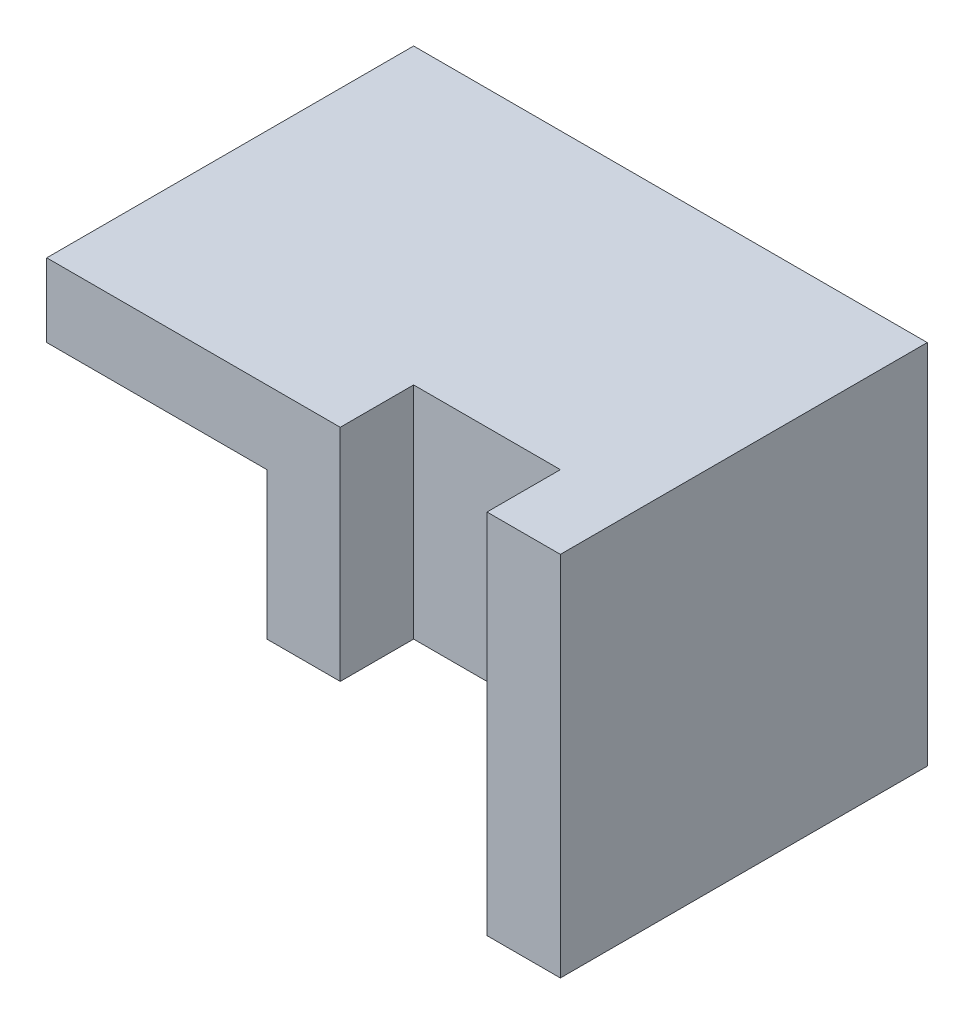
ISO-10303-21;
HEADER;
FILE_DESCRIPTION(('STEP AP214'),'2;1');
FILE_NAME('part.step','',(''),(''),'','','');
FILE_SCHEMA(('AUTOMOTIVE_DESIGN { 1 0 10303 214 1 1 1 1 }'));
ENDSEC;
DATA;
#1=APPLICATION_CONTEXT('core data for automotive mechanical design processes');
#2=APPLICATION_PROTOCOL_DEFINITION('international standard','automotive_design',2000,#1);
#3=PRODUCT_CONTEXT('',#1,'mechanical');
#4=PRODUCT('Part','Part','',(#3));
#5=PRODUCT_RELATED_PRODUCT_CATEGORY('part','',(#4));
#6=PRODUCT_DEFINITION_FORMATION('','',#4);
#7=PRODUCT_DEFINITION_CONTEXT('part definition',#1,'design');
#8=PRODUCT_DEFINITION('design','',#6,#7);
#9=PRODUCT_DEFINITION_SHAPE('','',#8);
#10=(LENGTH_UNIT() NAMED_UNIT(*) SI_UNIT(.MILLI.,.METRE.));
#11=(NAMED_UNIT(*) PLANE_ANGLE_UNIT() SI_UNIT($,.RADIAN.));
#12=(NAMED_UNIT(*) SI_UNIT($,.STERADIAN.) SOLID_ANGLE_UNIT());
#13=UNCERTAINTY_MEASURE_WITH_UNIT(LENGTH_MEASURE(1.E-05),#10,'distance_accuracy_value','');
#14=(GEOMETRIC_REPRESENTATION_CONTEXT(3) GLOBAL_UNCERTAINTY_ASSIGNED_CONTEXT((#13)) GLOBAL_UNIT_ASSIGNED_CONTEXT((#10,
#11,#12)) REPRESENTATION_CONTEXT('',''));
#15=CARTESIAN_POINT('',(0.,0.,0.));
#16=DIRECTION('',(0.,0.,1.));
#17=DIRECTION('',(1.,0.,0.));
#18=AXIS2_PLACEMENT_3D('',#15,#16,#17);
#19=CARTESIAN_POINT('',(0.,0.,50.));
#20=DIRECTION('',(0.,0.,-1.));
#21=DIRECTION('',(-1.,0.,0.));
#22=AXIS2_PLACEMENT_3D('',#19,#20,#21);
#23=PLANE('',#22);
#24=DIRECTION('',(-1.,0.,0.));
#25=VECTOR('',#24,1.);
#26=CARTESIAN_POINT('',(0.,50.,50.));
#27=LINE('',#26,#25);
#28=CARTESIAN_POINT('',(70.,50.,50.));
#29=VERTEX_POINT('',#28);
#30=CARTESIAN_POINT('',(60.,50.,50.));
#31=VERTEX_POINT('',#30);
#32=EDGE_CURVE('E192',#29,#31,#27,.T.);
#33=ORIENTED_EDGE('',*,*,#32,.T.);
#34=DIRECTION('',(0.,1.,0.));
#35=VECTOR('',#34,1.);
#36=CARTESIAN_POINT('',(60.,0.,50.));
#37=LINE('',#36,#35);
#38=CARTESIAN_POINT('',(60.,0.,50.));
#39=VERTEX_POINT('',#38);
#40=EDGE_CURVE('E153',#39,#31,#37,.T.);
#41=ORIENTED_EDGE('',*,*,#40,.F.);
#42=DIRECTION('',(1.,0.,0.));
#43=VECTOR('',#42,1.);
#44=CARTESIAN_POINT('',(0.,0.,50.));
#45=LINE('',#44,#43);
#46=CARTESIAN_POINT('',(70.,0.,50.));
#47=VERTEX_POINT('',#46);
#48=EDGE_CURVE('E186',#39,#47,#45,.T.);
#49=ORIENTED_EDGE('',*,*,#48,.T.);
#50=DIRECTION('',(0.,1.,0.));
#51=VECTOR('',#50,1.);
#52=CARTESIAN_POINT('',(70.,0.,50.));
#53=LINE('',#52,#51);
#54=EDGE_CURVE('E189',#47,#29,#53,.T.);
#55=ORIENTED_EDGE('',*,*,#54,.T.);
#56=EDGE_LOOP('',(#33,#41,#49,#55));
#57=FACE_BOUND('',#56,.T.);
#58=ADVANCED_FACE('F33',(#57),#23,.F.);
#59=CARTESIAN_POINT('',(0.,30.,50.));
#60=DIRECTION('',(-0.832050294337844,-0.554700196225229,0.));
#61=DIRECTION('',(0.554700196225229,-0.832050294337844,0.));
#62=AXIS2_PLACEMENT_3D('',#59,#60,#61);
#63=PLANE('',#62);
#64=DIRECTION('',(0.,0.,-1.));
#65=VECTOR('',#64,1.);
#66=CARTESIAN_POINT('',(20.,0.,50.));
#67=LINE('',#66,#65);
#68=CARTESIAN_POINT('',(20.,0.,10.));
#69=VERTEX_POINT('',#68);
#70=CARTESIAN_POINT('',(20.,0.,0.));
#71=VERTEX_POINT('',#70);
#72=EDGE_CURVE('E180',#69,#71,#67,.T.);
#73=ORIENTED_EDGE('',*,*,#72,.F.);
#74=DIRECTION('',(0.554700196225229,-0.832050294337844,0.));
#75=VECTOR('',#74,1.);
#76=CARTESIAN_POINT('',(0.,30.,10.));
#77=LINE('',#76,#75);
#78=CARTESIAN_POINT('',(0.,30.,10.));
#79=VERTEX_POINT('',#78);
#80=EDGE_CURVE('E175',#79,#69,#77,.T.);
#81=ORIENTED_EDGE('',*,*,#80,.F.);
#82=DIRECTION('',(0.,0.,-1.));
#83=VECTOR('',#82,1.);
#84=CARTESIAN_POINT('',(0.,30.,50.));
#85=LINE('',#84,#83);
#86=CARTESIAN_POINT('',(0.,30.,0.));
#87=VERTEX_POINT('',#86);
#88=EDGE_CURVE('E178',#79,#87,#85,.T.);
#89=ORIENTED_EDGE('',*,*,#88,.T.);
#90=DIRECTION('',(-0.554700196225229,0.832050294337844,0.));
#91=VECTOR('',#90,1.);
#92=CARTESIAN_POINT('',(0.,30.,0.));
#93=LINE('',#92,#91);
#94=EDGE_CURVE('E166',#71,#87,#93,.T.);
#95=ORIENTED_EDGE('',*,*,#94,.F.);
#96=EDGE_LOOP('',(#73,#81,#89,#95));
#97=FACE_BOUND('',#96,.T.);
#98=ADVANCED_FACE('F272',(#97),#63,.T.);
#99=CARTESIAN_POINT('',(0.,0.,50.));
#100=DIRECTION('',(1.,0.,0.));
#101=DIRECTION('',(0.,0.,-1.));
#102=AXIS2_PLACEMENT_3D('',#99,#100,#101);
#103=PLANE('',#102);
#104=DIRECTION('',(0.,-1.,0.));
#105=VECTOR('',#104,1.);
#106=CARTESIAN_POINT('',(0.,40.,10.));
#107=LINE('',#106,#105);
#108=CARTESIAN_POINT('',(0.,40.,10.));
#109=VERTEX_POINT('',#108);
#110=EDGE_CURVE('E56',#109,#79,#107,.T.);
#111=ORIENTED_EDGE('',*,*,#110,.F.);
#112=DIRECTION('',(0.,0.,1.));
#113=VECTOR('',#112,1.);
#114=CARTESIAN_POINT('',(0.,40.,10.));
#115=LINE('',#114,#113);
#116=CARTESIAN_POINT('',(0.,40.,50.));
#117=VERTEX_POINT('',#116);
#118=EDGE_CURVE('E163',#109,#117,#115,.T.);
#119=ORIENTED_EDGE('',*,*,#118,.T.);
#120=DIRECTION('',(0.,-1.,0.));
#121=VECTOR('',#120,1.);
#122=CARTESIAN_POINT('',(0.,0.,50.));
#123=LINE('',#122,#121);
#124=CARTESIAN_POINT('',(0.,50.,50.));
#125=VERTEX_POINT('',#124);
#126=EDGE_CURVE('E183',#125,#117,#123,.T.);
#127=ORIENTED_EDGE('',*,*,#126,.F.);
#128=DIRECTION('',(0.,0.,-1.));
#129=VECTOR('',#128,1.);
#130=CARTESIAN_POINT('',(0.,50.,50.));
#131=LINE('',#130,#129);
#132=CARTESIAN_POINT('',(0.,50.,0.));
#133=VERTEX_POINT('',#132);
#134=EDGE_CURVE('E195',#125,#133,#131,.T.);
#135=ORIENTED_EDGE('',*,*,#134,.T.);
#136=DIRECTION('',(0.,-1.,0.));
#137=VECTOR('',#136,1.);
#138=CARTESIAN_POINT('',(0.,0.,0.));
#139=LINE('',#138,#137);
#140=EDGE_CURVE('E182',#133,#87,#139,.T.);
#141=ORIENTED_EDGE('',*,*,#140,.T.);
#142=ORIENTED_EDGE('',*,*,#88,.F.);
#143=EDGE_LOOP('',(#111,#119,#127,#135,#141,#142));
#144=FACE_BOUND('',#143,.T.);
#145=ADVANCED_FACE('F35',(#144),#103,.F.);
#146=CARTESIAN_POINT('',(0.,0.,50.));
#147=DIRECTION('',(0.,1.,0.));
#148=DIRECTION('',(0.,0.,1.));
#149=AXIS2_PLACEMENT_3D('',#146,#147,#148);
#150=PLANE('',#149);
#151=ORIENTED_EDGE('',*,*,#48,.F.);
#152=DIRECTION('',(0.,0.,1.));
#153=VECTOR('',#152,1.);
#154=CARTESIAN_POINT('',(60.,0.,10.));
#155=LINE('',#154,#153);
#156=CARTESIAN_POINT('',(60.,0.,10.));
#157=VERTEX_POINT('',#156);
#158=EDGE_CURVE('E173',#157,#39,#155,.T.);
#159=ORIENTED_EDGE('',*,*,#158,.F.);
#160=DIRECTION('',(1.,0.,0.));
#161=VECTOR('',#160,1.);
#162=CARTESIAN_POINT('',(20.,0.,10.));
#163=LINE('',#162,#161);
#164=EDGE_CURVE('E162',#69,#157,#163,.T.);
#165=ORIENTED_EDGE('',*,*,#164,.F.);
#166=ORIENTED_EDGE('',*,*,#72,.T.);
#167=DIRECTION('',(1.,0.,0.));
#168=VECTOR('',#167,1.);
#169=CARTESIAN_POINT('',(0.,0.,0.));
#170=LINE('',#169,#168);
#171=CARTESIAN_POINT('',(70.,0.,0.));
#172=VERTEX_POINT('',#171);
#173=EDGE_CURVE('E198',#71,#172,#170,.T.);
#174=ORIENTED_EDGE('',*,*,#173,.T.);
#175=DIRECTION('',(0.,0.,-1.));
#176=VECTOR('',#175,1.);
#177=CARTESIAN_POINT('',(70.,0.,50.));
#178=LINE('',#177,#176);
#179=EDGE_CURVE('E11',#47,#172,#178,.T.);
#180=ORIENTED_EDGE('',*,*,#179,.F.);
#181=EDGE_LOOP('',(#151,#159,#165,#166,#174,#180));
#182=FACE_BOUND('',#181,.T.);
#183=ADVANCED_FACE('F261',(#182),#150,.F.);
#184=DIRECTION('',(-1.,0.,0.));
#185=VECTOR('',#184,1.);
#186=CARTESIAN_POINT('',(60.,20.,50.));
#187=LINE('',#186,#185);
#188=CARTESIAN_POINT('',(40.,20.,50.));
#189=VERTEX_POINT('',#188);
#190=CARTESIAN_POINT('',(30.,20.,50.));
#191=VERTEX_POINT('',#190);
#192=EDGE_CURVE('E145',#189,#191,#187,.T.);
#193=ORIENTED_EDGE('',*,*,#192,.F.);
#194=DIRECTION('',(0.,-1.,0.));
#195=VECTOR('',#194,1.);
#196=CARTESIAN_POINT('',(40.,60.,50.));
#197=LINE('',#196,#195);
#198=CARTESIAN_POINT('',(40.,50.,50.));
#199=VERTEX_POINT('',#198);
#200=EDGE_CURVE('E130',#199,#189,#197,.T.);
#201=ORIENTED_EDGE('',*,*,#200,.F.);
#202=EDGE_CURVE('E191',#199,#125,#27,.T.);
#203=ORIENTED_EDGE('',*,*,#202,.T.);
#204=ORIENTED_EDGE('',*,*,#126,.T.);
#205=DIRECTION('',(-1.,0.,0.));
#206=VECTOR('',#205,1.);
#207=CARTESIAN_POINT('',(30.,40.,50.));
#208=LINE('',#207,#206);
#209=CARTESIAN_POINT('',(30.,40.,50.));
#210=VERTEX_POINT('',#209);
#211=EDGE_CURVE('E155',#210,#117,#208,.T.);
#212=ORIENTED_EDGE('',*,*,#211,.F.);
#213=DIRECTION('',(0.,1.,0.));
#214=VECTOR('',#213,1.);
#215=CARTESIAN_POINT('',(30.,20.,50.));
#216=LINE('',#215,#214);
#217=EDGE_CURVE('E152',#191,#210,#216,.T.);
#218=ORIENTED_EDGE('',*,*,#217,.F.);
#219=EDGE_LOOP('',(#193,#201,#203,#204,#212,#218));
#220=FACE_BOUND('',#219,.T.);
#221=ADVANCED_FACE('F149',(#220),#23,.F.);
#222=CARTESIAN_POINT('',(0.,0.,0.));
#223=DIRECTION('',(0.,0.,-1.));
#224=DIRECTION('',(-1.,0.,0.));
#225=AXIS2_PLACEMENT_3D('',#222,#223,#224);
#226=PLANE('',#225);
#227=ORIENTED_EDGE('',*,*,#173,.F.);
#228=ORIENTED_EDGE('',*,*,#94,.T.);
#229=ORIENTED_EDGE('',*,*,#140,.F.);
#230=DIRECTION('',(-1.,0.,0.));
#231=VECTOR('',#230,1.);
#232=CARTESIAN_POINT('',(0.,50.,0.));
#233=LINE('',#232,#231);
#234=CARTESIAN_POINT('',(70.,50.,0.));
#235=VERTEX_POINT('',#234);
#236=EDGE_CURVE('E187',#235,#133,#233,.T.);
#237=ORIENTED_EDGE('',*,*,#236,.F.);
#238=DIRECTION('',(0.,1.,0.));
#239=VECTOR('',#238,1.);
#240=CARTESIAN_POINT('',(70.,0.,0.));
#241=LINE('',#240,#239);
#242=EDGE_CURVE('E200',#172,#235,#241,.T.);
#243=ORIENTED_EDGE('',*,*,#242,.F.);
#244=EDGE_LOOP('',(#227,#228,#229,#237,#243));
#245=FACE_BOUND('',#244,.T.);
#246=ADVANCED_FACE('F219',(#245),#226,.T.);
#247=CARTESIAN_POINT('',(70.,0.,50.));
#248=DIRECTION('',(-1.,0.,0.));
#249=DIRECTION('',(0.,0.,1.));
#250=AXIS2_PLACEMENT_3D('',#247,#248,#249);
#251=PLANE('',#250);
#252=ORIENTED_EDGE('',*,*,#242,.T.);
#253=DIRECTION('',(0.,0.,-1.));
#254=VECTOR('',#253,1.);
#255=CARTESIAN_POINT('',(70.,50.,50.));
#256=LINE('',#255,#254);
#257=EDGE_CURVE('E41',#29,#235,#256,.T.);
#258=ORIENTED_EDGE('',*,*,#257,.F.);
#259=ORIENTED_EDGE('',*,*,#54,.F.);
#260=ORIENTED_EDGE('',*,*,#179,.T.);
#261=EDGE_LOOP('',(#252,#258,#259,#260));
#262=FACE_BOUND('',#261,.T.);
#263=ADVANCED_FACE('F262',(#262),#251,.F.);
#264=CARTESIAN_POINT('',(0.,50.,50.));
#265=DIRECTION('',(0.,-1.,0.));
#266=DIRECTION('',(0.,0.,-1.));
#267=AXIS2_PLACEMENT_3D('',#264,#265,#266);
#268=PLANE('',#267);
#269=DIRECTION('',(1.,0.,0.));
#270=VECTOR('',#269,1.);
#271=CARTESIAN_POINT('',(0.,50.,40.));
#272=LINE('',#271,#270);
#273=CARTESIAN_POINT('',(40.,50.,40.));
#274=VERTEX_POINT('',#273);
#275=CARTESIAN_POINT('',(60.,50.,40.));
#276=VERTEX_POINT('',#275);
#277=EDGE_CURVE('E243',#274,#276,#272,.T.);
#278=ORIENTED_EDGE('',*,*,#277,.T.);
#279=DIRECTION('',(0.,0.,1.));
#280=VECTOR('',#279,1.);
#281=CARTESIAN_POINT('',(60.,50.,50.));
#282=LINE('',#281,#280);
#283=EDGE_CURVE('E157',#276,#31,#282,.T.);
#284=ORIENTED_EDGE('',*,*,#283,.T.);
#285=ORIENTED_EDGE('',*,*,#32,.F.);
#286=ORIENTED_EDGE('',*,*,#257,.T.);
#287=ORIENTED_EDGE('',*,*,#236,.T.);
#288=ORIENTED_EDGE('',*,*,#134,.F.);
#289=ORIENTED_EDGE('',*,*,#202,.F.);
#290=DIRECTION('',(0.,0.,-1.));
#291=VECTOR('',#290,1.);
#292=CARTESIAN_POINT('',(40.,50.,50.));
#293=LINE('',#292,#291);
#294=EDGE_CURVE('E136',#199,#274,#293,.T.);
#295=ORIENTED_EDGE('',*,*,#294,.T.);
#296=EDGE_LOOP('',(#278,#284,#285,#286,#287,#288,#289,#295));
#297=FACE_BOUND('',#296,.T.);
#298=ADVANCED_FACE('F210',(#297),#268,.F.);
#299=CARTESIAN_POINT('',(30.,40.,10.));
#300=DIRECTION('',(0.,1.,0.));
#301=DIRECTION('',(0.,0.,1.));
#302=AXIS2_PLACEMENT_3D('',#299,#300,#301);
#303=PLANE('',#302);
#304=ORIENTED_EDGE('',*,*,#211,.T.);
#305=ORIENTED_EDGE('',*,*,#118,.F.);
#306=DIRECTION('',(-1.,0.,0.));
#307=VECTOR('',#306,1.);
#308=CARTESIAN_POINT('',(30.,40.,10.));
#309=LINE('',#308,#307);
#310=CARTESIAN_POINT('',(30.,40.,10.));
#311=VERTEX_POINT('',#310);
#312=EDGE_CURVE('E227',#311,#109,#309,.T.);
#313=ORIENTED_EDGE('',*,*,#312,.F.);
#314=DIRECTION('',(0.,0.,1.));
#315=VECTOR('',#314,1.);
#316=CARTESIAN_POINT('',(30.,40.,10.));
#317=LINE('',#316,#315);
#318=EDGE_CURVE('E167',#311,#210,#317,.T.);
#319=ORIENTED_EDGE('',*,*,#318,.T.);
#320=EDGE_LOOP('',(#304,#305,#313,#319));
#321=FACE_BOUND('',#320,.T.);
#322=ADVANCED_FACE('F225',(#321),#303,.F.);
#323=CARTESIAN_POINT('',(30.,20.,10.));
#324=DIRECTION('',(1.,0.,0.));
#325=DIRECTION('',(0.,0.,-1.));
#326=AXIS2_PLACEMENT_3D('',#323,#324,#325);
#327=PLANE('',#326);
#328=ORIENTED_EDGE('',*,*,#217,.T.);
#329=ORIENTED_EDGE('',*,*,#318,.F.);
#330=DIRECTION('',(0.,1.,0.));
#331=VECTOR('',#330,1.);
#332=CARTESIAN_POINT('',(30.,20.,10.));
#333=LINE('',#332,#331);
#334=CARTESIAN_POINT('',(30.,20.,10.));
#335=VERTEX_POINT('',#334);
#336=EDGE_CURVE('E229',#335,#311,#333,.T.);
#337=ORIENTED_EDGE('',*,*,#336,.F.);
#338=DIRECTION('',(0.,0.,1.));
#339=VECTOR('',#338,1.);
#340=CARTESIAN_POINT('',(30.,20.,10.));
#341=LINE('',#340,#339);
#342=EDGE_CURVE('E169',#335,#191,#341,.T.);
#343=ORIENTED_EDGE('',*,*,#342,.T.);
#344=EDGE_LOOP('',(#328,#329,#337,#343));
#345=FACE_BOUND('',#344,.T.);
#346=ADVANCED_FACE('F321',(#345),#327,.F.);
#347=CARTESIAN_POINT('',(60.,20.,10.));
#348=DIRECTION('',(0.,1.,0.));
#349=DIRECTION('',(-1.,0.,0.));
#350=AXIS2_PLACEMENT_3D('',#347,#348,#349);
#351=PLANE('',#350);
#352=DIRECTION('',(0.,0.,1.));
#353=VECTOR('',#352,1.);
#354=CARTESIAN_POINT('',(60.,20.,10.));
#355=LINE('',#354,#353);
#356=CARTESIAN_POINT('',(60.,20.,10.));
#357=VERTEX_POINT('',#356);
#358=CARTESIAN_POINT('',(60.,20.,40.));
#359=VERTEX_POINT('',#358);
#360=EDGE_CURVE('E171',#357,#359,#355,.T.);
#361=ORIENTED_EDGE('',*,*,#360,.T.);
#362=DIRECTION('',(1.,0.,0.));
#363=VECTOR('',#362,1.);
#364=CARTESIAN_POINT('',(60.,20.,40.));
#365=LINE('',#364,#363);
#366=CARTESIAN_POINT('',(40.,20.,40.));
#367=VERTEX_POINT('',#366);
#368=EDGE_CURVE('E48',#367,#359,#365,.T.);
#369=ORIENTED_EDGE('',*,*,#368,.F.);
#370=DIRECTION('',(0.,0.,-1.));
#371=VECTOR('',#370,1.);
#372=CARTESIAN_POINT('',(40.,20.,50.));
#373=LINE('',#372,#371);
#374=EDGE_CURVE('E134',#189,#367,#373,.T.);
#375=ORIENTED_EDGE('',*,*,#374,.F.);
#376=ORIENTED_EDGE('',*,*,#192,.T.);
#377=ORIENTED_EDGE('',*,*,#342,.F.);
#378=DIRECTION('',(-1.,0.,0.));
#379=VECTOR('',#378,1.);
#380=CARTESIAN_POINT('',(60.,20.,10.));
#381=LINE('',#380,#379);
#382=EDGE_CURVE('E234',#357,#335,#381,.T.);
#383=ORIENTED_EDGE('',*,*,#382,.F.);
#384=EDGE_LOOP('',(#361,#369,#375,#376,#377,#383));
#385=FACE_BOUND('',#384,.T.);
#386=ADVANCED_FACE('F144',(#385),#351,.F.);
#387=CARTESIAN_POINT('',(60.,0.,10.));
#388=DIRECTION('',(1.,0.,0.));
#389=DIRECTION('',(0.,0.,-1.));
#390=AXIS2_PLACEMENT_3D('',#387,#388,#389);
#391=PLANE('',#390);
#392=ORIENTED_EDGE('',*,*,#40,.T.);
#393=ORIENTED_EDGE('',*,*,#283,.F.);
#394=DIRECTION('',(0.,-1.,0.));
#395=VECTOR('',#394,1.);
#396=CARTESIAN_POINT('',(60.,60.,40.));
#397=LINE('',#396,#395);
#398=EDGE_CURVE('E245',#276,#359,#397,.T.);
#399=ORIENTED_EDGE('',*,*,#398,.T.);
#400=ORIENTED_EDGE('',*,*,#360,.F.);
#401=DIRECTION('',(0.,1.,0.));
#402=VECTOR('',#401,1.);
#403=CARTESIAN_POINT('',(60.,0.,10.));
#404=LINE('',#403,#402);
#405=EDGE_CURVE('E237',#157,#357,#404,.T.);
#406=ORIENTED_EDGE('',*,*,#405,.F.);
#407=ORIENTED_EDGE('',*,*,#158,.T.);
#408=EDGE_LOOP('',(#392,#393,#399,#400,#406,#407));
#409=FACE_BOUND('',#408,.T.);
#410=ADVANCED_FACE('F250',(#409),#391,.F.);
#411=CARTESIAN_POINT('',(0.,0.,10.));
#412=DIRECTION('',(0.,0.,1.));
#413=DIRECTION('',(1.,0.,0.));
#414=AXIS2_PLACEMENT_3D('',#411,#412,#413);
#415=PLANE('',#414);
#416=ORIENTED_EDGE('',*,*,#164,.T.);
#417=ORIENTED_EDGE('',*,*,#405,.T.);
#418=ORIENTED_EDGE('',*,*,#382,.T.);
#419=ORIENTED_EDGE('',*,*,#336,.T.);
#420=ORIENTED_EDGE('',*,*,#312,.T.);
#421=ORIENTED_EDGE('',*,*,#110,.T.);
#422=ORIENTED_EDGE('',*,*,#80,.T.);
#423=EDGE_LOOP('',(#416,#417,#418,#419,#420,#421,#422));
#424=FACE_BOUND('',#423,.T.);
#425=ADVANCED_FACE('F253',(#424),#415,.T.);
#426=CARTESIAN_POINT('',(60.,60.,40.));
#427=DIRECTION('',(0.,0.,-1.));
#428=DIRECTION('',(-1.,0.,0.));
#429=AXIS2_PLACEMENT_3D('',#426,#427,#428);
#430=PLANE('',#429);
#431=DIRECTION('',(0.,-1.,0.));
#432=VECTOR('',#431,1.);
#433=CARTESIAN_POINT('',(40.,60.,40.));
#434=LINE('',#433,#432);
#435=EDGE_CURVE('E140',#274,#367,#434,.T.);
#436=ORIENTED_EDGE('',*,*,#435,.T.);
#437=ORIENTED_EDGE('',*,*,#368,.T.);
#438=ORIENTED_EDGE('',*,*,#398,.F.);
#439=ORIENTED_EDGE('',*,*,#277,.F.);
#440=EDGE_LOOP('',(#436,#437,#438,#439));
#441=FACE_BOUND('',#440,.T.);
#442=ADVANCED_FACE('F340',(#441),#430,.F.);
#443=CARTESIAN_POINT('',(40.,60.,50.));
#444=DIRECTION('',(-1.,0.,0.));
#445=DIRECTION('',(0.,0.,1.));
#446=AXIS2_PLACEMENT_3D('',#443,#444,#445);
#447=PLANE('',#446);
#448=ORIENTED_EDGE('',*,*,#200,.T.);
#449=ORIENTED_EDGE('',*,*,#374,.T.);
#450=ORIENTED_EDGE('',*,*,#435,.F.);
#451=ORIENTED_EDGE('',*,*,#294,.F.);
#452=EDGE_LOOP('',(#448,#449,#450,#451));
#453=FACE_BOUND('',#452,.T.);
#454=ADVANCED_FACE('F132',(#453),#447,.F.);
#455=CLOSED_SHELL('',(#58,#98,#145,#183,#221,#246,#263,#298,#322,#346,#386,#410,#425,#442,#454));
#456=MANIFOLD_SOLID_BREP('B2',#455);
#457=ADVANCED_BREP_SHAPE_REPRESENTATION('',(#18,#456),#14);
#458=SHAPE_DEFINITION_REPRESENTATION(#9,#457);
ENDSEC;
END-ISO-10303-21;
